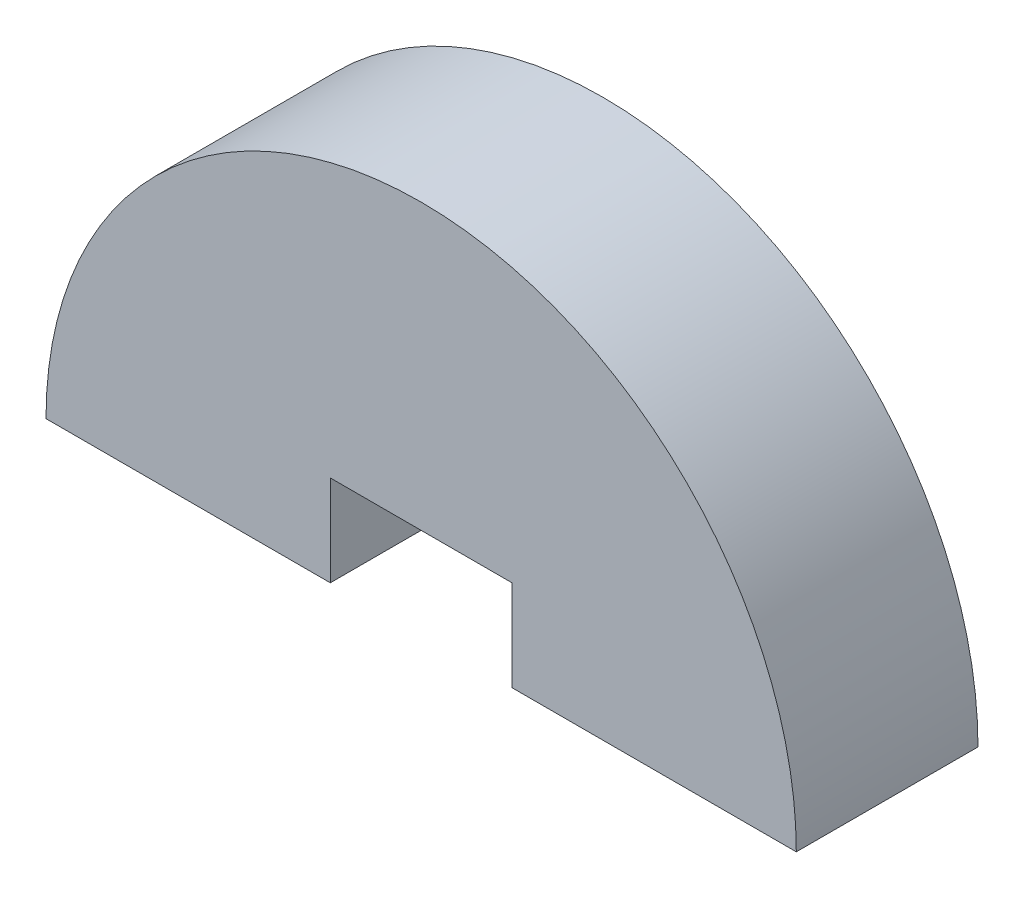
ISO-10303-21;
HEADER;
FILE_DESCRIPTION(('STEP AP214'),'2;1');
FILE_NAME('part.step','',(''),(''),'','','');
FILE_SCHEMA(('AUTOMOTIVE_DESIGN { 1 0 10303 214 1 1 1 1 }'));
ENDSEC;
DATA;
#1=APPLICATION_CONTEXT('core data for automotive mechanical design processes');
#2=APPLICATION_PROTOCOL_DEFINITION('international standard','automotive_design',2000,#1);
#3=PRODUCT_CONTEXT('',#1,'mechanical');
#4=PRODUCT('Part','Part','',(#3));
#5=PRODUCT_RELATED_PRODUCT_CATEGORY('part','',(#4));
#6=PRODUCT_DEFINITION_FORMATION('','',#4);
#7=PRODUCT_DEFINITION_CONTEXT('part definition',#1,'design');
#8=PRODUCT_DEFINITION('design','',#6,#7);
#9=PRODUCT_DEFINITION_SHAPE('','',#8);
#10=(LENGTH_UNIT() NAMED_UNIT(*) SI_UNIT(.MILLI.,.METRE.));
#11=(NAMED_UNIT(*) PLANE_ANGLE_UNIT() SI_UNIT($,.RADIAN.));
#12=(NAMED_UNIT(*) SI_UNIT($,.STERADIAN.) SOLID_ANGLE_UNIT());
#13=UNCERTAINTY_MEASURE_WITH_UNIT(LENGTH_MEASURE(1.E-05),#10,'distance_accuracy_value','');
#14=(GEOMETRIC_REPRESENTATION_CONTEXT(3) GLOBAL_UNCERTAINTY_ASSIGNED_CONTEXT((#13)) GLOBAL_UNIT_ASSIGNED_CONTEXT((#10,
#11,#12)) REPRESENTATION_CONTEXT('',''));
#15=CARTESIAN_POINT('',(0.,0.,0.));
#16=DIRECTION('',(0.,0.,1.));
#17=DIRECTION('',(1.,0.,0.));
#18=AXIS2_PLACEMENT_3D('',#15,#16,#17);
#19=CARTESIAN_POINT('',(3777.19732959978,1712.0899304223,6.));
#20=DIRECTION('',(0.,1.,0.));
#21=DIRECTION('',(0.,0.,1.));
#22=AXIS2_PLACEMENT_3D('',#19,#20,#21);
#23=PLANE('',#22);
#24=DIRECTION('',(1.,0.,0.));
#25=VECTOR('',#24,1.);
#26=CARTESIAN_POINT('',(3777.19732959978,1712.0899304223,0.));
#27=LINE('',#26,#25);
#28=CARTESIAN_POINT('',(3777.19732959978,1712.0899304223,0.));
#29=VERTEX_POINT('',#28);
#30=CARTESIAN_POINT('',(3786.58583573705,1712.0899304223,0.));
#31=VERTEX_POINT('',#30);
#32=EDGE_CURVE('E128',#29,#31,#27,.T.);
#33=ORIENTED_EDGE('',*,*,#32,.T.);
#34=DIRECTION('',(0.,0.,-1.));
#35=VECTOR('',#34,1.);
#36=CARTESIAN_POINT('',(3786.58583573705,1712.0899304223,6.));
#37=LINE('',#36,#35);
#38=CARTESIAN_POINT('',(3786.58583573705,1712.0899304223,6.));
#39=VERTEX_POINT('',#38);
#40=EDGE_CURVE('E11',#39,#31,#37,.T.);
#41=ORIENTED_EDGE('',*,*,#40,.F.);
#42=DIRECTION('',(1.,0.,0.));
#43=VECTOR('',#42,1.);
#44=CARTESIAN_POINT('',(3777.19732959978,1712.0899304223,6.));
#45=LINE('',#44,#43);
#46=CARTESIAN_POINT('',(3777.19732959978,1712.0899304223,6.));
#47=VERTEX_POINT('',#46);
#48=EDGE_CURVE('E147',#47,#39,#45,.T.);
#49=ORIENTED_EDGE('',*,*,#48,.F.);
#50=DIRECTION('',(0.,0.,-1.));
#51=VECTOR('',#50,1.);
#52=CARTESIAN_POINT('',(3777.19732959978,1712.0899304223,6.));
#53=LINE('',#52,#51);
#54=EDGE_CURVE('E56',#47,#29,#53,.T.);
#55=ORIENTED_EDGE('',*,*,#54,.T.);
#56=EDGE_LOOP('',(#33,#41,#49,#55));
#57=FACE_BOUND('',#56,.T.);
#58=ADVANCED_FACE('F39',(#57),#23,.F.);
#59=CARTESIAN_POINT('',(3774.19732959978,1712.08993042229,6.));
#60=DIRECTION('',(0.,0.,-1.));
#61=DIRECTION('',(-1.,0.,0.));
#62=AXIS2_PLACEMENT_3D('',#59,#60,#61);
#63=CYLINDRICAL_SURFACE('',#62,12.3885061372631);
#64=CARTESIAN_POINT('',(3774.19732959978,1712.08993042229,0.));
#65=DIRECTION('',(0.,0.,1.));
#66=DIRECTION('',(1.,0.,0.));
#67=AXIS2_PLACEMENT_3D('',#64,#65,#66);
#68=CIRCLE('',#67,12.3885061372631);
#69=CARTESIAN_POINT('',(3761.80882346252,1712.0899304223,0.));
#70=VERTEX_POINT('',#69);
#71=EDGE_CURVE('E131',#31,#70,#68,.T.);
#72=ORIENTED_EDGE('',*,*,#71,.T.);
#73=DIRECTION('',(0.,0.,-1.));
#74=VECTOR('',#73,1.);
#75=CARTESIAN_POINT('',(3761.80882346252,1712.0899304223,6.));
#76=LINE('',#75,#74);
#77=CARTESIAN_POINT('',(3761.80882346252,1712.0899304223,6.));
#78=VERTEX_POINT('',#77);
#79=EDGE_CURVE('E48',#78,#70,#76,.T.);
#80=ORIENTED_EDGE('',*,*,#79,.F.);
#81=CARTESIAN_POINT('',(3774.19732959978,1712.08993042229,6.));
#82=DIRECTION('',(0.,0.,1.));
#83=DIRECTION('',(1.,0.,0.));
#84=AXIS2_PLACEMENT_3D('',#81,#82,#83);
#85=CIRCLE('',#84,12.3885061372631);
#86=EDGE_CURVE('E88',#39,#78,#85,.T.);
#87=ORIENTED_EDGE('',*,*,#86,.F.);
#88=ORIENTED_EDGE('',*,*,#40,.T.);
#89=EDGE_LOOP('',(#72,#80,#87,#88));
#90=FACE_BOUND('',#89,.T.);
#91=ADVANCED_FACE('F171',(#90),#63,.T.);
#92=CARTESIAN_POINT('',(3761.80882346252,1712.0899304223,6.));
#93=DIRECTION('',(0.,1.,0.));
#94=DIRECTION('',(0.,0.,1.));
#95=AXIS2_PLACEMENT_3D('',#92,#93,#94);
#96=PLANE('',#95);
#97=DIRECTION('',(1.,0.,0.));
#98=VECTOR('',#97,1.);
#99=CARTESIAN_POINT('',(3761.80882346252,1712.0899304223,0.));
#100=LINE('',#99,#98);
#101=CARTESIAN_POINT('',(3771.19732959978,1712.0899304223,0.));
#102=VERTEX_POINT('',#101);
#103=EDGE_CURVE('E134',#70,#102,#100,.T.);
#104=ORIENTED_EDGE('',*,*,#103,.T.);
#105=DIRECTION('',(0.,0.,-1.));
#106=VECTOR('',#105,1.);
#107=CARTESIAN_POINT('',(3771.19732959978,1712.0899304223,6.));
#108=LINE('',#107,#106);
#109=CARTESIAN_POINT('',(3771.19732959978,1712.0899304223,6.));
#110=VERTEX_POINT('',#109);
#111=EDGE_CURVE('E108',#110,#102,#108,.T.);
#112=ORIENTED_EDGE('',*,*,#111,.F.);
#113=DIRECTION('',(1.,0.,0.));
#114=VECTOR('',#113,1.);
#115=CARTESIAN_POINT('',(3761.80882346252,1712.0899304223,6.));
#116=LINE('',#115,#114);
#117=EDGE_CURVE('E116',#78,#110,#116,.T.);
#118=ORIENTED_EDGE('',*,*,#117,.F.);
#119=ORIENTED_EDGE('',*,*,#79,.T.);
#120=EDGE_LOOP('',(#104,#112,#118,#119));
#121=FACE_BOUND('',#120,.T.);
#122=ADVANCED_FACE('F157',(#121),#96,.F.);
#123=CARTESIAN_POINT('',(3771.19732959978,1715.0899304223,6.));
#124=DIRECTION('',(1.,0.,0.));
#125=DIRECTION('',(0.,0.,-1.));
#126=AXIS2_PLACEMENT_3D('',#123,#124,#125);
#127=PLANE('',#126);
#128=DIRECTION('',(0.,-1.,0.));
#129=VECTOR('',#128,1.);
#130=CARTESIAN_POINT('',(3771.19732959978,1715.0899304223,0.));
#131=LINE('',#130,#129);
#132=CARTESIAN_POINT('',(3771.19732959978,1715.0899304223,0.));
#133=VERTEX_POINT('',#132);
#134=EDGE_CURVE('E103',#133,#102,#131,.T.);
#135=ORIENTED_EDGE('',*,*,#134,.F.);
#136=DIRECTION('',(0.,0.,-1.));
#137=VECTOR('',#136,1.);
#138=CARTESIAN_POINT('',(3771.19732959978,1715.0899304223,6.));
#139=LINE('',#138,#137);
#140=CARTESIAN_POINT('',(3771.19732959978,1715.0899304223,6.));
#141=VERTEX_POINT('',#140);
#142=EDGE_CURVE('E98',#141,#133,#139,.T.);
#143=ORIENTED_EDGE('',*,*,#142,.F.);
#144=DIRECTION('',(0.,-1.,0.));
#145=VECTOR('',#144,1.);
#146=CARTESIAN_POINT('',(3771.19732959978,1715.0899304223,6.));
#147=LINE('',#146,#145);
#148=EDGE_CURVE('E101',#141,#110,#147,.T.);
#149=ORIENTED_EDGE('',*,*,#148,.T.);
#150=ORIENTED_EDGE('',*,*,#111,.T.);
#151=EDGE_LOOP('',(#135,#143,#149,#150));
#152=FACE_BOUND('',#151,.T.);
#153=ADVANCED_FACE('F100',(#152),#127,.T.);
#154=CARTESIAN_POINT('',(3777.19732959978,1715.0899304223,6.));
#155=DIRECTION('',(0.,-1.,0.));
#156=DIRECTION('',(0.,0.,-1.));
#157=AXIS2_PLACEMENT_3D('',#154,#155,#156);
#158=PLANE('',#157);
#159=DIRECTION('',(-1.,0.,0.));
#160=VECTOR('',#159,1.);
#161=CARTESIAN_POINT('',(3777.19732959978,1715.0899304223,0.));
#162=LINE('',#161,#160);
#163=CARTESIAN_POINT('',(3777.19732959978,1715.0899304223,0.));
#164=VERTEX_POINT('',#163);
#165=EDGE_CURVE('E140',#164,#133,#162,.T.);
#166=ORIENTED_EDGE('',*,*,#165,.F.);
#167=DIRECTION('',(0.,0.,-1.));
#168=VECTOR('',#167,1.);
#169=CARTESIAN_POINT('',(3777.19732959978,1715.0899304223,6.));
#170=LINE('',#169,#168);
#171=CARTESIAN_POINT('',(3777.19732959978,1715.0899304223,6.));
#172=VERTEX_POINT('',#171);
#173=EDGE_CURVE('E76',#172,#164,#170,.T.);
#174=ORIENTED_EDGE('',*,*,#173,.F.);
#175=DIRECTION('',(-1.,0.,0.));
#176=VECTOR('',#175,1.);
#177=CARTESIAN_POINT('',(3777.19732959978,1715.0899304223,6.));
#178=LINE('',#177,#176);
#179=EDGE_CURVE('E114',#172,#141,#178,.T.);
#180=ORIENTED_EDGE('',*,*,#179,.T.);
#181=ORIENTED_EDGE('',*,*,#142,.T.);
#182=EDGE_LOOP('',(#166,#174,#180,#181));
#183=FACE_BOUND('',#182,.T.);
#184=ADVANCED_FACE('F120',(#183),#158,.T.);
#185=CARTESIAN_POINT('',(3777.19732959978,1712.0899304223,6.));
#186=DIRECTION('',(-1.,0.,0.));
#187=DIRECTION('',(0.,0.,1.));
#188=AXIS2_PLACEMENT_3D('',#185,#186,#187);
#189=PLANE('',#188);
#190=DIRECTION('',(0.,1.,0.));
#191=VECTOR('',#190,1.);
#192=CARTESIAN_POINT('',(3777.19732959978,1712.0899304223,0.));
#193=LINE('',#192,#191);
#194=EDGE_CURVE('E143',#29,#164,#193,.T.);
#195=ORIENTED_EDGE('',*,*,#194,.F.);
#196=ORIENTED_EDGE('',*,*,#54,.F.);
#197=DIRECTION('',(0.,1.,0.));
#198=VECTOR('',#197,1.);
#199=CARTESIAN_POINT('',(3777.19732959978,1712.0899304223,6.));
#200=LINE('',#199,#198);
#201=EDGE_CURVE('E122',#47,#172,#200,.T.);
#202=ORIENTED_EDGE('',*,*,#201,.T.);
#203=ORIENTED_EDGE('',*,*,#173,.T.);
#204=EDGE_LOOP('',(#195,#196,#202,#203));
#205=FACE_BOUND('',#204,.T.);
#206=ADVANCED_FACE('F160',(#205),#189,.T.);
#207=CARTESIAN_POINT('',(3774.19732959978,1712.08993042229,6.));
#208=DIRECTION('',(0.,0.,1.));
#209=DIRECTION('',(1.,0.,0.));
#210=AXIS2_PLACEMENT_3D('',#207,#208,#209);
#211=PLANE('',#210);
#212=ORIENTED_EDGE('',*,*,#48,.T.);
#213=ORIENTED_EDGE('',*,*,#86,.T.);
#214=ORIENTED_EDGE('',*,*,#117,.T.);
#215=ORIENTED_EDGE('',*,*,#148,.F.);
#216=ORIENTED_EDGE('',*,*,#179,.F.);
#217=ORIENTED_EDGE('',*,*,#201,.F.);
#218=EDGE_LOOP('',(#212,#213,#214,#215,#216,#217));
#219=FACE_BOUND('',#218,.T.);
#220=ADVANCED_FACE('F112',(#219),#211,.T.);
#221=CARTESIAN_POINT('',(3774.19732959978,1712.08993042229,0.));
#222=DIRECTION('',(0.,0.,1.));
#223=DIRECTION('',(1.,0.,0.));
#224=AXIS2_PLACEMENT_3D('',#221,#222,#223);
#225=PLANE('',#224);
#226=ORIENTED_EDGE('',*,*,#32,.F.);
#227=ORIENTED_EDGE('',*,*,#194,.T.);
#228=ORIENTED_EDGE('',*,*,#165,.T.);
#229=ORIENTED_EDGE('',*,*,#134,.T.);
#230=ORIENTED_EDGE('',*,*,#103,.F.);
#231=ORIENTED_EDGE('',*,*,#71,.F.);
#232=EDGE_LOOP('',(#226,#227,#228,#229,#230,#231));
#233=FACE_BOUND('',#232,.T.);
#234=ADVANCED_FACE('F159',(#233),#225,.F.);
#235=CLOSED_SHELL('',(#58,#91,#122,#153,#184,#206,#220,#234));
#236=MANIFOLD_SOLID_BREP('B2',#235);
#237=ADVANCED_BREP_SHAPE_REPRESENTATION('',(#18,#236),#14);
#238=SHAPE_DEFINITION_REPRESENTATION(#9,#237);
ENDSEC;
END-ISO-10303-21;
